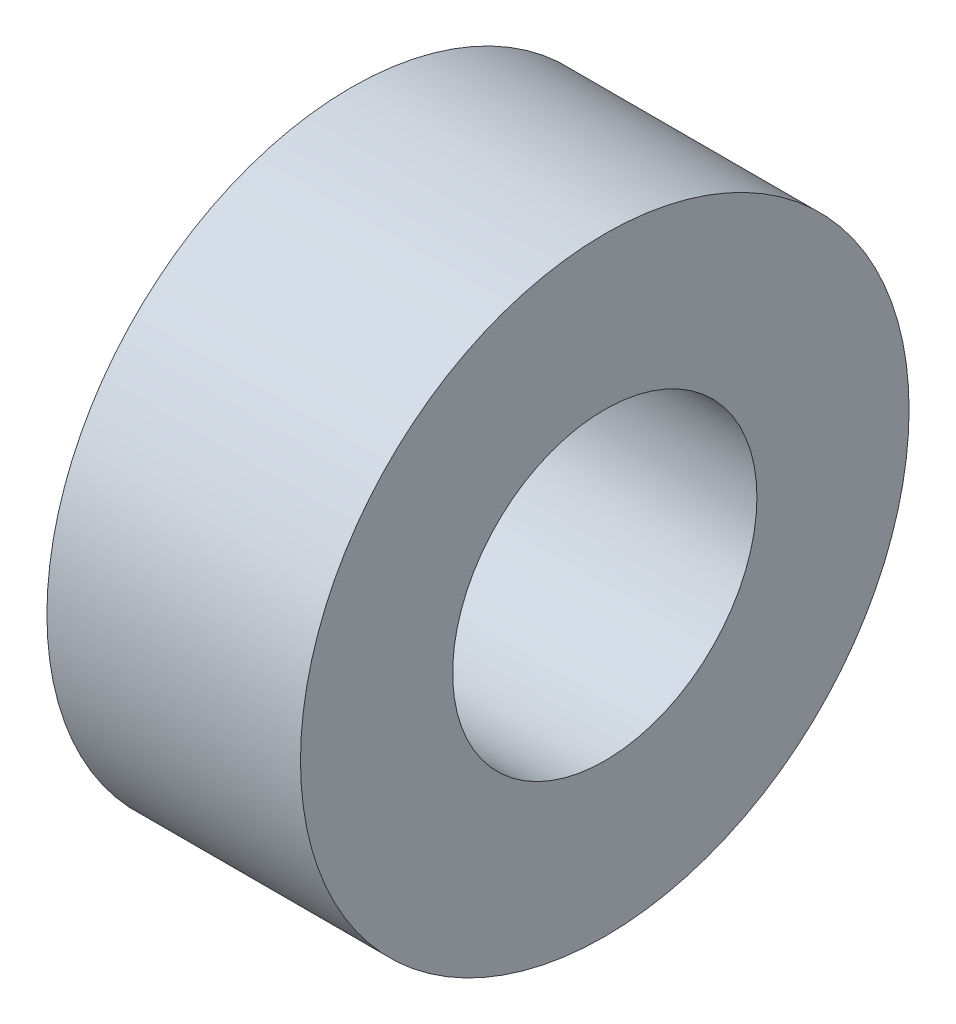
ISO-10303-21;
HEADER;
FILE_DESCRIPTION(('STEP AP214'),'2;1');
FILE_NAME('part.step','',(''),(''),'','','');
FILE_SCHEMA(('AUTOMOTIVE_DESIGN { 1 0 10303 214 1 1 1 1 }'));
ENDSEC;
DATA;
#1=APPLICATION_CONTEXT('core data for automotive mechanical design processes');
#2=APPLICATION_PROTOCOL_DEFINITION('international standard','automotive_design',2000,#1);
#3=PRODUCT_CONTEXT('',#1,'mechanical');
#4=PRODUCT('Part','Part','',(#3));
#5=PRODUCT_RELATED_PRODUCT_CATEGORY('part','',(#4));
#6=PRODUCT_DEFINITION_FORMATION('','',#4);
#7=PRODUCT_DEFINITION_CONTEXT('part definition',#1,'design');
#8=PRODUCT_DEFINITION('design','',#6,#7);
#9=PRODUCT_DEFINITION_SHAPE('','',#8);
#10=(LENGTH_UNIT() NAMED_UNIT(*) SI_UNIT(.MILLI.,.METRE.));
#11=(NAMED_UNIT(*) PLANE_ANGLE_UNIT() SI_UNIT($,.RADIAN.));
#12=(NAMED_UNIT(*) SI_UNIT($,.STERADIAN.) SOLID_ANGLE_UNIT());
#13=UNCERTAINTY_MEASURE_WITH_UNIT(LENGTH_MEASURE(1.E-05),#10,'distance_accuracy_value','');
#14=(GEOMETRIC_REPRESENTATION_CONTEXT(3) GLOBAL_UNCERTAINTY_ASSIGNED_CONTEXT((#13)) GLOBAL_UNIT_ASSIGNED_CONTEXT((#10,
#11,#12)) REPRESENTATION_CONTEXT('',''));
#15=CARTESIAN_POINT('',(0.,0.,0.));
#16=DIRECTION('',(0.,0.,1.));
#17=DIRECTION('',(1.,0.,0.));
#18=AXIS2_PLACEMENT_3D('',#15,#16,#17);
#19=CARTESIAN_POINT('',(1.25,3.,0.));
#20=DIRECTION('',(-1.,0.,0.));
#21=DIRECTION('',(0.,0.,1.));
#22=AXIS2_PLACEMENT_3D('',#19,#20,#21);
#23=PLANE('',#22);
#24=CARTESIAN_POINT('',(1.25,0.,0.));
#25=DIRECTION('',(1.,0.,0.));
#26=DIRECTION('',(0.,0.,-1.));
#27=AXIS2_PLACEMENT_3D('',#24,#25,#26);
#28=CIRCLE('',#27,1.5);
#29=CARTESIAN_POINT('',(1.25,0.,-1.5));
#30=VERTEX_POINT('',#29);
#31=EDGE_CURVE('E10',#30,#30,#28,.T.);
#32=ORIENTED_EDGE('',*,*,#31,.F.);
#33=EDGE_LOOP('',(#32));
#34=FACE_BOUND('',#33,.T.);
#35=CARTESIAN_POINT('',(1.25,0.,0.));
#36=DIRECTION('',(1.,0.,0.));
#37=DIRECTION('',(0.,0.,-1.));
#38=AXIS2_PLACEMENT_3D('',#35,#36,#37);
#39=CIRCLE('',#38,3.);
#40=CARTESIAN_POINT('',(1.25,0.,-3.));
#41=VERTEX_POINT('',#40);
#42=EDGE_CURVE('E46',#41,#41,#39,.T.);
#43=ORIENTED_EDGE('',*,*,#42,.T.);
#44=EDGE_LOOP('',(#43));
#45=FACE_BOUND('',#44,.T.);
#46=ADVANCED_FACE('F32',(#34,#45),#23,.F.);
#47=CARTESIAN_POINT('',(2.89567247594883,0.,0.));
#48=DIRECTION('',(1.,0.,0.));
#49=DIRECTION('',(0.,0.,-1.));
#50=AXIS2_PLACEMENT_3D('',#47,#48,#49);
#51=CYLINDRICAL_SURFACE('',#50,1.5);
#52=CARTESIAN_POINT('',(-1.25,0.,0.));
#53=DIRECTION('',(1.,0.,0.));
#54=DIRECTION('',(0.,0.,-1.));
#55=AXIS2_PLACEMENT_3D('',#52,#53,#54);
#56=CIRCLE('',#55,1.5);
#57=CARTESIAN_POINT('',(-1.25,0.,-1.5));
#58=VERTEX_POINT('',#57);
#59=EDGE_CURVE('E38',#58,#58,#56,.T.);
#60=ORIENTED_EDGE('',*,*,#59,.F.);
#61=EDGE_LOOP('',(#60));
#62=FACE_BOUND('',#61,.T.);
#63=ORIENTED_EDGE('',*,*,#31,.T.);
#64=EDGE_LOOP('',(#63));
#65=FACE_BOUND('',#64,.T.);
#66=ADVANCED_FACE('F61',(#62,#65),#51,.F.);
#67=CARTESIAN_POINT('',(-1.25,3.,0.));
#68=DIRECTION('',(1.,0.,0.));
#69=DIRECTION('',(0.,0.,-1.));
#70=AXIS2_PLACEMENT_3D('',#67,#68,#69);
#71=PLANE('',#70);
#72=CARTESIAN_POINT('',(-1.25,0.,0.));
#73=DIRECTION('',(1.,0.,0.));
#74=DIRECTION('',(0.,0.,-1.));
#75=AXIS2_PLACEMENT_3D('',#72,#73,#74);
#76=CIRCLE('',#75,3.);
#77=CARTESIAN_POINT('',(-1.25,0.,-3.));
#78=VERTEX_POINT('',#77);
#79=EDGE_CURVE('E42',#78,#78,#76,.T.);
#80=ORIENTED_EDGE('',*,*,#79,.F.);
#81=EDGE_LOOP('',(#80));
#82=FACE_BOUND('',#81,.T.);
#83=ORIENTED_EDGE('',*,*,#59,.T.);
#84=EDGE_LOOP('',(#83));
#85=FACE_BOUND('',#84,.T.);
#86=ADVANCED_FACE('F56',(#82,#85),#71,.F.);
#87=CARTESIAN_POINT('',(2.89567247594883,0.,0.));
#88=DIRECTION('',(1.,0.,0.));
#89=DIRECTION('',(0.,0.,-1.));
#90=AXIS2_PLACEMENT_3D('',#87,#88,#89);
#91=CYLINDRICAL_SURFACE('',#90,3.);
#92=ORIENTED_EDGE('',*,*,#42,.F.);
#93=EDGE_LOOP('',(#92));
#94=FACE_BOUND('',#93,.T.);
#95=ORIENTED_EDGE('',*,*,#79,.T.);
#96=EDGE_LOOP('',(#95));
#97=FACE_BOUND('',#96,.T.);
#98=ADVANCED_FACE('F53',(#94,#97),#91,.T.);
#99=CLOSED_SHELL('',(#46,#66,#86,#98));
#100=MANIFOLD_SOLID_BREP('B2',#99);
#101=ADVANCED_BREP_SHAPE_REPRESENTATION('',(#18,#100),#14);
#102=SHAPE_DEFINITION_REPRESENTATION(#9,#101);
ENDSEC;
END-ISO-10303-21;
